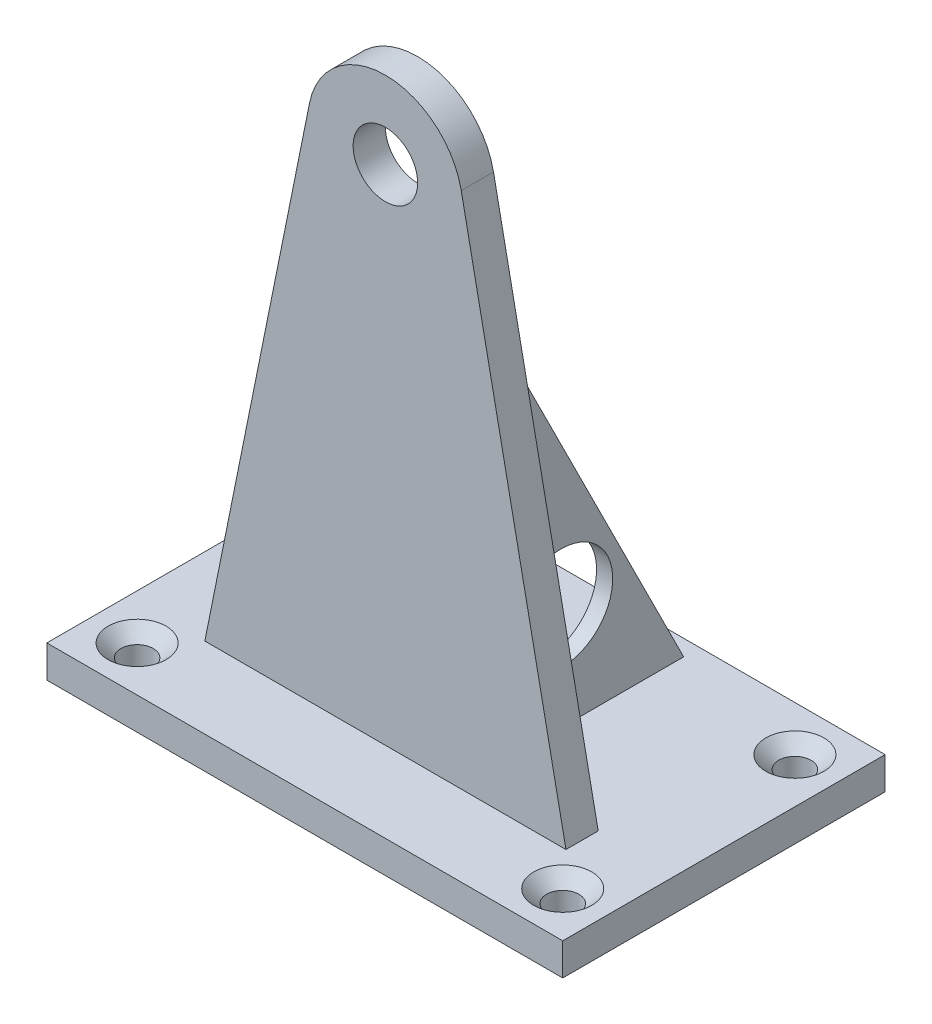
ISO-10303-21;
HEADER;
FILE_DESCRIPTION(('STEP AP214'),'2;1');
FILE_NAME('part.step','',(''),(''),'','','');
FILE_SCHEMA(('AUTOMOTIVE_DESIGN { 1 0 10303 214 1 1 1 1 }'));
ENDSEC;
DATA;
#1=APPLICATION_CONTEXT('core data for automotive mechanical design processes');
#2=APPLICATION_PROTOCOL_DEFINITION('international standard','automotive_design',2000,#1);
#3=PRODUCT_CONTEXT('',#1,'mechanical');
#4=PRODUCT('Part','Part','',(#3));
#5=PRODUCT_RELATED_PRODUCT_CATEGORY('part','',(#4));
#6=PRODUCT_DEFINITION_FORMATION('','',#4);
#7=PRODUCT_DEFINITION_CONTEXT('part definition',#1,'design');
#8=PRODUCT_DEFINITION('design','',#6,#7);
#9=PRODUCT_DEFINITION_SHAPE('','',#8);
#10=(LENGTH_UNIT() NAMED_UNIT(*) SI_UNIT(.MILLI.,.METRE.));
#11=(NAMED_UNIT(*) PLANE_ANGLE_UNIT() SI_UNIT($,.RADIAN.));
#12=(NAMED_UNIT(*) SI_UNIT($,.STERADIAN.) SOLID_ANGLE_UNIT());
#13=UNCERTAINTY_MEASURE_WITH_UNIT(LENGTH_MEASURE(1.E-05),#10,'distance_accuracy_value','');
#14=(GEOMETRIC_REPRESENTATION_CONTEXT(3) GLOBAL_UNCERTAINTY_ASSIGNED_CONTEXT((#13)) GLOBAL_UNIT_ASSIGNED_CONTEXT((#10,
#11,#12)) REPRESENTATION_CONTEXT('',''));
#15=CARTESIAN_POINT('',(0.,0.,0.));
#16=DIRECTION('',(0.,0.,1.));
#17=DIRECTION('',(1.,0.,0.));
#18=AXIS2_PLACEMENT_3D('',#15,#16,#17);
#19=CARTESIAN_POINT('',(40.,5.,25.));
#20=DIRECTION('',(-1.,0.,0.));
#21=DIRECTION('',(0.,0.,1.));
#22=AXIS2_PLACEMENT_3D('',#19,#20,#21);
#23=PLANE('',#22);
#24=DIRECTION('',(0.,0.,-1.));
#25=VECTOR('',#24,1.);
#26=CARTESIAN_POINT('',(40.,0.,25.));
#27=LINE('',#26,#25);
#28=CARTESIAN_POINT('',(40.,0.,25.));
#29=VERTEX_POINT('',#28);
#30=CARTESIAN_POINT('',(40.,0.,-25.));
#31=VERTEX_POINT('',#30);
#32=EDGE_CURVE('E264',#29,#31,#27,.T.);
#33=ORIENTED_EDGE('',*,*,#32,.T.);
#34=DIRECTION('',(0.,-1.,0.));
#35=VECTOR('',#34,1.);
#36=CARTESIAN_POINT('',(40.,5.,-25.));
#37=LINE('',#36,#35);
#38=CARTESIAN_POINT('',(40.,5.,-25.));
#39=VERTEX_POINT('',#38);
#40=EDGE_CURVE('E304',#39,#31,#37,.T.);
#41=ORIENTED_EDGE('',*,*,#40,.F.);
#42=DIRECTION('',(0.,0.,-1.));
#43=VECTOR('',#42,1.);
#44=CARTESIAN_POINT('',(40.,5.,25.));
#45=LINE('',#44,#43);
#46=CARTESIAN_POINT('',(40.,5.,25.));
#47=VERTEX_POINT('',#46);
#48=EDGE_CURVE('E267',#47,#39,#45,.T.);
#49=ORIENTED_EDGE('',*,*,#48,.F.);
#50=DIRECTION('',(0.,-1.,0.));
#51=VECTOR('',#50,1.);
#52=CARTESIAN_POINT('',(40.,5.,25.));
#53=LINE('',#52,#51);
#54=EDGE_CURVE('E281',#47,#29,#53,.T.);
#55=ORIENTED_EDGE('',*,*,#54,.T.);
#56=EDGE_LOOP('',(#33,#41,#49,#55));
#57=FACE_BOUND('',#56,.T.);
#58=ADVANCED_FACE('F52',(#57),#23,.F.);
#59=CARTESIAN_POINT('',(-40.,5.,-25.));
#60=DIRECTION('',(0.,0.,1.));
#61=DIRECTION('',(1.,0.,0.));
#62=AXIS2_PLACEMENT_3D('',#59,#60,#61);
#63=PLANE('',#62);
#64=DIRECTION('',(-1.,0.,0.));
#65=VECTOR('',#64,1.);
#66=CARTESIAN_POINT('',(-40.,0.,-25.));
#67=LINE('',#66,#65);
#68=CARTESIAN_POINT('',(-40.,0.,-25.));
#69=VERTEX_POINT('',#68);
#70=EDGE_CURVE('E285',#31,#69,#67,.T.);
#71=ORIENTED_EDGE('',*,*,#70,.T.);
#72=DIRECTION('',(0.,-1.,0.));
#73=VECTOR('',#72,1.);
#74=CARTESIAN_POINT('',(-40.,5.,-25.));
#75=LINE('',#74,#73);
#76=CARTESIAN_POINT('',(-40.,5.,-25.));
#77=VERTEX_POINT('',#76);
#78=EDGE_CURVE('E300',#77,#69,#75,.T.);
#79=ORIENTED_EDGE('',*,*,#78,.F.);
#80=DIRECTION('',(-1.,0.,0.));
#81=VECTOR('',#80,1.);
#82=CARTESIAN_POINT('',(-40.,5.,-25.));
#83=LINE('',#82,#81);
#84=EDGE_CURVE('E271',#39,#77,#83,.T.);
#85=ORIENTED_EDGE('',*,*,#84,.F.);
#86=ORIENTED_EDGE('',*,*,#40,.T.);
#87=EDGE_LOOP('',(#71,#79,#85,#86));
#88=FACE_BOUND('',#87,.T.);
#89=ADVANCED_FACE('F363',(#88),#63,.F.);
#90=CARTESIAN_POINT('',(-40.,5.,25.));
#91=DIRECTION('',(1.,0.,0.));
#92=DIRECTION('',(0.,0.,-1.));
#93=AXIS2_PLACEMENT_3D('',#90,#91,#92);
#94=PLANE('',#93);
#95=DIRECTION('',(0.,0.,1.));
#96=VECTOR('',#95,1.);
#97=CARTESIAN_POINT('',(-40.,0.,25.));
#98=LINE('',#97,#96);
#99=CARTESIAN_POINT('',(-40.,0.,25.));
#100=VERTEX_POINT('',#99);
#101=EDGE_CURVE('E288',#69,#100,#98,.T.);
#102=ORIENTED_EDGE('',*,*,#101,.T.);
#103=DIRECTION('',(0.,-1.,0.));
#104=VECTOR('',#103,1.);
#105=CARTESIAN_POINT('',(-40.,5.,25.));
#106=LINE('',#105,#104);
#107=CARTESIAN_POINT('',(-40.,5.,25.));
#108=VERTEX_POINT('',#107);
#109=EDGE_CURVE('E296',#108,#100,#106,.T.);
#110=ORIENTED_EDGE('',*,*,#109,.F.);
#111=DIRECTION('',(0.,0.,1.));
#112=VECTOR('',#111,1.);
#113=CARTESIAN_POINT('',(-40.,5.,25.));
#114=LINE('',#113,#112);
#115=EDGE_CURVE('E275',#77,#108,#114,.T.);
#116=ORIENTED_EDGE('',*,*,#115,.F.);
#117=ORIENTED_EDGE('',*,*,#78,.T.);
#118=EDGE_LOOP('',(#102,#110,#116,#117));
#119=FACE_BOUND('',#118,.T.);
#120=ADVANCED_FACE('F369',(#119),#94,.F.);
#121=CARTESIAN_POINT('',(-40.,5.,25.));
#122=DIRECTION('',(0.,0.,-1.));
#123=DIRECTION('',(-1.,0.,0.));
#124=AXIS2_PLACEMENT_3D('',#121,#122,#123);
#125=PLANE('',#124);
#126=DIRECTION('',(1.,0.,0.));
#127=VECTOR('',#126,1.);
#128=CARTESIAN_POINT('',(-40.,0.,25.));
#129=LINE('',#128,#127);
#130=EDGE_CURVE('E272',#100,#29,#129,.T.);
#131=ORIENTED_EDGE('',*,*,#130,.T.);
#132=ORIENTED_EDGE('',*,*,#54,.F.);
#133=DIRECTION('',(1.,0.,0.));
#134=VECTOR('',#133,1.);
#135=CARTESIAN_POINT('',(-40.,5.,25.));
#136=LINE('',#135,#134);
#137=EDGE_CURVE('E278',#108,#47,#136,.T.);
#138=ORIENTED_EDGE('',*,*,#137,.F.);
#139=ORIENTED_EDGE('',*,*,#109,.T.);
#140=EDGE_LOOP('',(#131,#132,#138,#139));
#141=FACE_BOUND('',#140,.T.);
#142=ADVANCED_FACE('F486',(#141),#125,.F.);
#143=CARTESIAN_POINT('',(0.,5.,0.));
#144=DIRECTION('',(0.,-1.,0.));
#145=DIRECTION('',(0.,0.,-1.));
#146=AXIS2_PLACEMENT_3D('',#143,#144,#145);
#147=PLANE('',#146);
#148=CARTESIAN_POINT('',(33.,5.,-18.));
#149=DIRECTION('',(0.,-1.,0.));
#150=DIRECTION('',(0.,0.,-1.));
#151=AXIS2_PLACEMENT_3D('',#148,#149,#150);
#152=CIRCLE('',#151,4.50000000000003);
#153=CARTESIAN_POINT('',(33.,5.,-22.5));
#154=VERTEX_POINT('',#153);
#155=EDGE_CURVE('E332',#154,#154,#152,.T.);
#156=ORIENTED_EDGE('',*,*,#155,.T.);
#157=EDGE_LOOP('',(#156));
#158=FACE_BOUND('',#157,.T.);
#159=CARTESIAN_POINT('',(-33.,5.,-18.));
#160=DIRECTION('',(0.,-1.,0.));
#161=DIRECTION('',(0.,0.,-1.));
#162=AXIS2_PLACEMENT_3D('',#159,#160,#161);
#163=CIRCLE('',#162,4.50000000000003);
#164=CARTESIAN_POINT('',(-33.,5.,-22.5));
#165=VERTEX_POINT('',#164);
#166=EDGE_CURVE('E328',#165,#165,#163,.T.);
#167=ORIENTED_EDGE('',*,*,#166,.T.);
#168=EDGE_LOOP('',(#167));
#169=FACE_BOUND('',#168,.T.);
#170=CARTESIAN_POINT('',(-33.,5.,18.));
#171=DIRECTION('',(0.,-1.,0.));
#172=DIRECTION('',(0.,0.,-1.));
#173=AXIS2_PLACEMENT_3D('',#170,#171,#172);
#174=CIRCLE('',#173,4.50000000000003);
#175=CARTESIAN_POINT('',(-33.,5.,13.5));
#176=VERTEX_POINT('',#175);
#177=EDGE_CURVE('E324',#176,#176,#174,.T.);
#178=ORIENTED_EDGE('',*,*,#177,.T.);
#179=EDGE_LOOP('',(#178));
#180=FACE_BOUND('',#179,.T.);
#181=CARTESIAN_POINT('',(33.,5.,18.));
#182=DIRECTION('',(0.,-1.,0.));
#183=DIRECTION('',(0.,0.,-1.));
#184=AXIS2_PLACEMENT_3D('',#181,#182,#183);
#185=CIRCLE('',#184,4.50000000000003);
#186=CARTESIAN_POINT('',(33.,5.,13.5));
#187=VERTEX_POINT('',#186);
#188=EDGE_CURVE('E320',#187,#187,#185,.T.);
#189=ORIENTED_EDGE('',*,*,#188,.T.);
#190=EDGE_LOOP('',(#189));
#191=FACE_BOUND('',#190,.T.);
#192=DIRECTION('',(0.,0.,1.));
#193=VECTOR('',#192,1.);
#194=CARTESIAN_POINT('',(28.,5.,7.5));
#195=LINE('',#194,#193);
#196=CARTESIAN_POINT('',(28.,5.,7.5));
#197=VERTEX_POINT('',#196);
#198=CARTESIAN_POINT('',(28.,5.,12.5));
#199=VERTEX_POINT('',#198);
#200=EDGE_CURVE('E195',#197,#199,#195,.T.);
#201=ORIENTED_EDGE('',*,*,#200,.T.);
#202=DIRECTION('',(1.,0.,0.));
#203=VECTOR('',#202,1.);
#204=CARTESIAN_POINT('',(0.,5.,12.5));
#205=LINE('',#204,#203);
#206=CARTESIAN_POINT('',(-28.,5.,12.5));
#207=VERTEX_POINT('',#206);
#208=EDGE_CURVE('E240',#207,#199,#205,.T.);
#209=ORIENTED_EDGE('',*,*,#208,.F.);
#210=DIRECTION('',(0.,0.,1.));
#211=VECTOR('',#210,1.);
#212=CARTESIAN_POINT('',(-28.,5.,7.5));
#213=LINE('',#212,#211);
#214=CARTESIAN_POINT('',(-28.,5.,7.5));
#215=VERTEX_POINT('',#214);
#216=EDGE_CURVE('E260',#215,#207,#213,.T.);
#217=ORIENTED_EDGE('',*,*,#216,.F.);
#218=DIRECTION('',(1.,0.,0.));
#219=VECTOR('',#218,1.);
#220=CARTESIAN_POINT('',(0.,5.,7.5));
#221=LINE('',#220,#219);
#222=CARTESIAN_POINT('',(-11.25,5.,7.5));
#223=VERTEX_POINT('',#222);
#224=EDGE_CURVE('E245',#215,#223,#221,.T.);
#225=ORIENTED_EDGE('',*,*,#224,.T.);
#226=DIRECTION('',(0.,0.,1.));
#227=VECTOR('',#226,1.);
#228=CARTESIAN_POINT('',(-11.25,5.,0.));
#229=LINE('',#228,#227);
#230=CARTESIAN_POINT('',(-11.25,5.,-22.5));
#231=VERTEX_POINT('',#230);
#232=EDGE_CURVE('E77',#231,#223,#229,.T.);
#233=ORIENTED_EDGE('',*,*,#232,.F.);
#234=DIRECTION('',(-1.,0.,0.));
#235=VECTOR('',#234,1.);
#236=CARTESIAN_POINT('',(0.,5.,-22.5));
#237=LINE('',#236,#235);
#238=CARTESIAN_POINT('',(-8.75,5.,-22.5));
#239=VERTEX_POINT('',#238);
#240=EDGE_CURVE('E230',#231,#239,#237,.F.);
#241=ORIENTED_EDGE('',*,*,#240,.T.);
#242=DIRECTION('',(0.,0.,1.));
#243=VECTOR('',#242,1.);
#244=CARTESIAN_POINT('',(-8.75,5.,0.));
#245=LINE('',#244,#243);
#246=CARTESIAN_POINT('',(-8.75,5.,7.5));
#247=VERTEX_POINT('',#246);
#248=EDGE_CURVE('E221',#239,#247,#245,.T.);
#249=ORIENTED_EDGE('',*,*,#248,.T.);
#250=CARTESIAN_POINT('',(8.75,5.,7.5));
#251=VERTEX_POINT('',#250);
#252=EDGE_CURVE('E250',#247,#251,#221,.T.);
#253=ORIENTED_EDGE('',*,*,#252,.T.);
#254=DIRECTION('',(0.,0.,-1.));
#255=VECTOR('',#254,1.);
#256=CARTESIAN_POINT('',(8.75,5.,0.));
#257=LINE('',#256,#255);
#258=CARTESIAN_POINT('',(8.75,5.,-22.5));
#259=VERTEX_POINT('',#258);
#260=EDGE_CURVE('E180',#251,#259,#257,.T.);
#261=ORIENTED_EDGE('',*,*,#260,.T.);
#262=DIRECTION('',(1.,0.,0.));
#263=VECTOR('',#262,1.);
#264=CARTESIAN_POINT('',(0.,5.,-22.5));
#265=LINE('',#264,#263);
#266=CARTESIAN_POINT('',(11.25,5.,-22.5));
#267=VERTEX_POINT('',#266);
#268=EDGE_CURVE('E167',#259,#267,#265,.T.);
#269=ORIENTED_EDGE('',*,*,#268,.T.);
#270=DIRECTION('',(0.,0.,-1.));
#271=VECTOR('',#270,1.);
#272=CARTESIAN_POINT('',(11.25,5.,0.));
#273=LINE('',#272,#271);
#274=CARTESIAN_POINT('',(11.25,5.,7.5));
#275=VERTEX_POINT('',#274);
#276=EDGE_CURVE('E154',#275,#267,#273,.T.);
#277=ORIENTED_EDGE('',*,*,#276,.F.);
#278=EDGE_CURVE('E244',#275,#197,#221,.T.);
#279=ORIENTED_EDGE('',*,*,#278,.T.);
#280=EDGE_LOOP('',(#201,#209,#217,#225,#233,#241,#249,#253,#261,#269,#277,#279));
#281=FACE_BOUND('',#280,.T.);
#282=ORIENTED_EDGE('',*,*,#137,.T.);
#283=ORIENTED_EDGE('',*,*,#48,.T.);
#284=ORIENTED_EDGE('',*,*,#84,.T.);
#285=ORIENTED_EDGE('',*,*,#115,.T.);
#286=EDGE_LOOP('',(#282,#283,#284,#285));
#287=FACE_BOUND('',#286,.T.);
#288=ADVANCED_FACE('F177',(#158,#169,#180,#191,#281,#287),#147,.F.);
#289=CARTESIAN_POINT('',(0.,0.,0.));
#290=DIRECTION('',(0.,-1.,0.));
#291=DIRECTION('',(0.,0.,-1.));
#292=AXIS2_PLACEMENT_3D('',#289,#290,#291);
#293=PLANE('',#292);
#294=CARTESIAN_POINT('',(33.,0.,-18.));
#295=DIRECTION('',(0.,1.,0.));
#296=DIRECTION('',(0.,0.,-1.));
#297=AXIS2_PLACEMENT_3D('',#294,#295,#296);
#298=CIRCLE('',#297,2.5);
#299=CARTESIAN_POINT('',(33.,0.,-20.5));
#300=VERTEX_POINT('',#299);
#301=EDGE_CURVE('E399',#300,#300,#298,.T.);
#302=ORIENTED_EDGE('',*,*,#301,.T.);
#303=EDGE_LOOP('',(#302));
#304=FACE_BOUND('',#303,.T.);
#305=CARTESIAN_POINT('',(33.,0.,18.));
#306=DIRECTION('',(0.,1.,0.));
#307=DIRECTION('',(0.,0.,1.));
#308=AXIS2_PLACEMENT_3D('',#305,#306,#307);
#309=CIRCLE('',#308,2.5);
#310=CARTESIAN_POINT('',(33.,0.,20.5));
#311=VERTEX_POINT('',#310);
#312=EDGE_CURVE('E402',#311,#311,#309,.T.);
#313=ORIENTED_EDGE('',*,*,#312,.T.);
#314=EDGE_LOOP('',(#313));
#315=FACE_BOUND('',#314,.T.);
#316=CARTESIAN_POINT('',(-33.,0.,18.));
#317=DIRECTION('',(0.,1.,0.));
#318=DIRECTION('',(0.,0.,-1.));
#319=AXIS2_PLACEMENT_3D('',#316,#317,#318);
#320=CIRCLE('',#319,2.5);
#321=CARTESIAN_POINT('',(-33.,0.,15.5));
#322=VERTEX_POINT('',#321);
#323=EDGE_CURVE('E409',#322,#322,#320,.T.);
#324=ORIENTED_EDGE('',*,*,#323,.T.);
#325=EDGE_LOOP('',(#324));
#326=FACE_BOUND('',#325,.T.);
#327=CARTESIAN_POINT('',(-33.,0.,-18.));
#328=DIRECTION('',(0.,1.,0.));
#329=DIRECTION('',(0.,0.,1.));
#330=AXIS2_PLACEMENT_3D('',#327,#328,#329);
#331=CIRCLE('',#330,2.5);
#332=CARTESIAN_POINT('',(-33.,0.,-15.5));
#333=VERTEX_POINT('',#332);
#334=EDGE_CURVE('E316',#333,#333,#331,.T.);
#335=ORIENTED_EDGE('',*,*,#334,.T.);
#336=EDGE_LOOP('',(#335));
#337=FACE_BOUND('',#336,.T.);
#338=ORIENTED_EDGE('',*,*,#101,.F.);
#339=ORIENTED_EDGE('',*,*,#70,.F.);
#340=ORIENTED_EDGE('',*,*,#32,.F.);
#341=ORIENTED_EDGE('',*,*,#130,.F.);
#342=EDGE_LOOP('',(#338,#339,#340,#341));
#343=FACE_BOUND('',#342,.T.);
#344=ADVANCED_FACE('F479',(#304,#315,#326,#337,#343),#293,.T.);
#345=CARTESIAN_POINT('',(-28.,5.,7.5));
#346=DIRECTION('',(-0.98019801980198,0.198019801980198,0.));
#347=DIRECTION('',(-0.198019801980198,-0.98019801980198,0.));
#348=AXIS2_PLACEMENT_3D('',#345,#346,#347);
#349=PLANE('',#348);
#350=DIRECTION('',(-0.198019801980198,-0.98019801980198,0.));
#351=VECTOR('',#350,1.);
#352=CARTESIAN_POINT('',(-28.,5.,12.5));
#353=LINE('',#352,#351);
#354=CARTESIAN_POINT('',(-11.7623762376238,85.3762376237624,12.5));
#355=VERTEX_POINT('',#354);
#356=EDGE_CURVE('E254',#355,#207,#353,.T.);
#357=ORIENTED_EDGE('',*,*,#356,.F.);
#358=DIRECTION('',(0.,0.,1.));
#359=VECTOR('',#358,1.);
#360=CARTESIAN_POINT('',(-11.7623762376238,85.3762376237624,7.5));
#361=LINE('',#360,#359);
#362=CARTESIAN_POINT('',(-11.7623762376238,85.3762376237624,7.5));
#363=VERTEX_POINT('',#362);
#364=EDGE_CURVE('E249',#363,#355,#361,.T.);
#365=ORIENTED_EDGE('',*,*,#364,.F.);
#366=DIRECTION('',(-0.198019801980198,-0.98019801980198,0.));
#367=VECTOR('',#366,1.);
#368=CARTESIAN_POINT('',(-28.,5.,7.5));
#369=LINE('',#368,#367);
#370=EDGE_CURVE('E239',#363,#215,#369,.T.);
#371=ORIENTED_EDGE('',*,*,#370,.T.);
#372=ORIENTED_EDGE('',*,*,#216,.T.);
#373=EDGE_LOOP('',(#357,#365,#371,#372));
#374=FACE_BOUND('',#373,.T.);
#375=ADVANCED_FACE('F476',(#374),#349,.T.);
#376=CARTESIAN_POINT('',(0.,83.,7.5));
#377=DIRECTION('',(0.,0.,1.));
#378=DIRECTION('',(1.,0.,0.));
#379=AXIS2_PLACEMENT_3D('',#376,#377,#378);
#380=CYLINDRICAL_SURFACE('',#379,12.);
#381=CARTESIAN_POINT('',(0.,83.,12.5));
#382=DIRECTION('',(0.,0.,1.));
#383=DIRECTION('',(-1.,0.,0.));
#384=AXIS2_PLACEMENT_3D('',#381,#382,#383);
#385=CIRCLE('',#384,12.);
#386=CARTESIAN_POINT('',(11.7623762376238,85.3762376237624,12.5));
#387=VERTEX_POINT('',#386);
#388=EDGE_CURVE('E234',#387,#355,#385,.T.);
#389=ORIENTED_EDGE('',*,*,#388,.F.);
#390=DIRECTION('',(0.,0.,1.));
#391=VECTOR('',#390,1.);
#392=CARTESIAN_POINT('',(11.7623762376238,85.3762376237624,7.5));
#393=LINE('',#392,#391);
#394=CARTESIAN_POINT('',(11.7623762376238,85.3762376237624,7.5));
#395=VERTEX_POINT('',#394);
#396=EDGE_CURVE('E197',#395,#387,#393,.T.);
#397=ORIENTED_EDGE('',*,*,#396,.F.);
#398=CARTESIAN_POINT('',(0.,83.,7.5));
#399=DIRECTION('',(0.,0.,1.));
#400=DIRECTION('',(-1.,0.,0.));
#401=AXIS2_PLACEMENT_3D('',#398,#399,#400);
#402=CIRCLE('',#401,12.);
#403=EDGE_CURVE('E235',#395,#363,#402,.T.);
#404=ORIENTED_EDGE('',*,*,#403,.T.);
#405=ORIENTED_EDGE('',*,*,#364,.T.);
#406=EDGE_LOOP('',(#389,#397,#404,#405));
#407=FACE_BOUND('',#406,.T.);
#408=ADVANCED_FACE('F471',(#407),#380,.T.);
#409=CARTESIAN_POINT('',(0.,83.,7.5));
#410=DIRECTION('',(0.,0.,-1.));
#411=DIRECTION('',(-1.,0.,0.));
#412=AXIS2_PLACEMENT_3D('',#409,#410,#411);
#413=PLANE('',#412);
#414=CARTESIAN_POINT('',(0.,83.,7.5));
#415=DIRECTION('',(0.,0.,1.));
#416=DIRECTION('',(1.,0.,0.));
#417=AXIS2_PLACEMENT_3D('',#414,#415,#416);
#418=CIRCLE('',#417,5.);
#419=CARTESIAN_POINT('',(5.,83.,7.5));
#420=VERTEX_POINT('',#419);
#421=EDGE_CURVE('E403',#420,#420,#418,.T.);
#422=ORIENTED_EDGE('',*,*,#421,.T.);
#423=EDGE_LOOP('',(#422));
#424=FACE_BOUND('',#423,.T.);
#425=DIRECTION('',(0.,1.,0.));
#426=VECTOR('',#425,1.);
#427=CARTESIAN_POINT('',(8.75,83.,7.5));
#428=LINE('',#427,#426);
#429=CARTESIAN_POINT('',(8.75,65.,7.5));
#430=VERTEX_POINT('',#429);
#431=EDGE_CURVE('E162',#251,#430,#428,.T.);
#432=ORIENTED_EDGE('',*,*,#431,.F.);
#433=ORIENTED_EDGE('',*,*,#252,.F.);
#434=DIRECTION('',(0.,-1.,0.));
#435=VECTOR('',#434,1.);
#436=CARTESIAN_POINT('',(-8.75,83.,7.5));
#437=LINE('',#436,#435);
#438=CARTESIAN_POINT('',(-8.75,65.,7.5));
#439=VERTEX_POINT('',#438);
#440=EDGE_CURVE('E218',#439,#247,#437,.T.);
#441=ORIENTED_EDGE('',*,*,#440,.F.);
#442=DIRECTION('',(-1.,0.,0.));
#443=VECTOR('',#442,1.);
#444=CARTESIAN_POINT('',(0.,65.,7.5));
#445=LINE('',#444,#443);
#446=CARTESIAN_POINT('',(-11.25,65.,7.5));
#447=VERTEX_POINT('',#446);
#448=EDGE_CURVE('E225',#447,#439,#445,.F.);
#449=ORIENTED_EDGE('',*,*,#448,.F.);
#450=DIRECTION('',(0.,-1.,0.));
#451=VECTOR('',#450,1.);
#452=CARTESIAN_POINT('',(-11.25,83.,7.5));
#453=LINE('',#452,#451);
#454=EDGE_CURVE('E213',#447,#223,#453,.T.);
#455=ORIENTED_EDGE('',*,*,#454,.T.);
#456=ORIENTED_EDGE('',*,*,#224,.F.);
#457=ORIENTED_EDGE('',*,*,#370,.F.);
#458=ORIENTED_EDGE('',*,*,#403,.F.);
#459=DIRECTION('',(0.198019801980198,-0.98019801980198,0.));
#460=VECTOR('',#459,1.);
#461=CARTESIAN_POINT('',(28.,5.,7.5));
#462=LINE('',#461,#460);
#463=EDGE_CURVE('E188',#395,#197,#462,.T.);
#464=ORIENTED_EDGE('',*,*,#463,.T.);
#465=ORIENTED_EDGE('',*,*,#278,.F.);
#466=DIRECTION('',(0.,1.,0.));
#467=VECTOR('',#466,1.);
#468=CARTESIAN_POINT('',(11.25,83.,7.5));
#469=LINE('',#468,#467);
#470=CARTESIAN_POINT('',(11.25,65.,7.5));
#471=VERTEX_POINT('',#470);
#472=EDGE_CURVE('E157',#275,#471,#469,.T.);
#473=ORIENTED_EDGE('',*,*,#472,.T.);
#474=DIRECTION('',(1.,0.,0.));
#475=VECTOR('',#474,1.);
#476=CARTESIAN_POINT('',(0.,65.,7.5));
#477=LINE('',#476,#475);
#478=EDGE_CURVE('E170',#430,#471,#477,.T.);
#479=ORIENTED_EDGE('',*,*,#478,.F.);
#480=EDGE_LOOP('',(#432,#433,#441,#449,#455,#456,#457,#458,#464,#465,#473,#479));
#481=FACE_BOUND('',#480,.T.);
#482=ADVANCED_FACE('F434',(#424,#481),#413,.T.);
#483=CARTESIAN_POINT('',(0.,83.,12.5));
#484=DIRECTION('',(0.,0.,-1.));
#485=DIRECTION('',(-1.,0.,0.));
#486=AXIS2_PLACEMENT_3D('',#483,#484,#485);
#487=PLANE('',#486);
#488=CARTESIAN_POINT('',(0.,83.,12.5));
#489=DIRECTION('',(0.,0.,1.));
#490=DIRECTION('',(1.,0.,0.));
#491=AXIS2_PLACEMENT_3D('',#488,#489,#490);
#492=CIRCLE('',#491,5.);
#493=CARTESIAN_POINT('',(5.,83.,12.5));
#494=VERTEX_POINT('',#493);
#495=EDGE_CURVE('E412',#494,#494,#492,.T.);
#496=ORIENTED_EDGE('',*,*,#495,.F.);
#497=EDGE_LOOP('',(#496));
#498=FACE_BOUND('',#497,.T.);
#499=ORIENTED_EDGE('',*,*,#208,.T.);
#500=DIRECTION('',(0.198019801980198,-0.98019801980198,0.));
#501=VECTOR('',#500,1.);
#502=CARTESIAN_POINT('',(28.,5.,12.5));
#503=LINE('',#502,#501);
#504=EDGE_CURVE('E182',#387,#199,#503,.T.);
#505=ORIENTED_EDGE('',*,*,#504,.F.);
#506=ORIENTED_EDGE('',*,*,#388,.T.);
#507=ORIENTED_EDGE('',*,*,#356,.T.);
#508=EDGE_LOOP('',(#499,#505,#506,#507));
#509=FACE_BOUND('',#508,.T.);
#510=ADVANCED_FACE('F468',(#498,#509),#487,.F.);
#511=CARTESIAN_POINT('',(-10.,65.,7.5));
#512=DIRECTION('',(0.,-0.447213595499958,0.894427190999916));
#513=DIRECTION('',(0.,-0.894427190999916,-0.447213595499958));
#514=AXIS2_PLACEMENT_3D('',#511,#512,#513);
#515=PLANE('',#514);
#516=ORIENTED_EDGE('',*,*,#240,.F.);
#517=DIRECTION('',(0.,-0.894427190999916,-0.447213595499958));
#518=VECTOR('',#517,1.);
#519=CARTESIAN_POINT('',(-11.25,65.,7.5));
#520=LINE('',#519,#518);
#521=EDGE_CURVE('E208',#447,#231,#520,.T.);
#522=ORIENTED_EDGE('',*,*,#521,.F.);
#523=ORIENTED_EDGE('',*,*,#448,.T.);
#524=DIRECTION('',(0.,-0.894427190999916,-0.447213595499958));
#525=VECTOR('',#524,1.);
#526=CARTESIAN_POINT('',(-8.75,65.,7.5));
#527=LINE('',#526,#525);
#528=EDGE_CURVE('E209',#439,#239,#527,.T.);
#529=ORIENTED_EDGE('',*,*,#528,.T.);
#530=EDGE_LOOP('',(#516,#522,#523,#529));
#531=FACE_BOUND('',#530,.T.);
#532=ADVANCED_FACE('F447',(#531),#515,.F.);
#533=CARTESIAN_POINT('',(-8.75,47.5,0.));
#534=DIRECTION('',(1.,0.,0.));
#535=DIRECTION('',(0.,0.,-1.));
#536=AXIS2_PLACEMENT_3D('',#533,#534,#535);
#537=PLANE('',#536);
#538=CARTESIAN_POINT('',(-8.75,21.,-3.5));
#539=DIRECTION('',(1.,0.,0.));
#540=DIRECTION('',(0.,0.,-1.));
#541=AXIS2_PLACEMENT_3D('',#538,#539,#540);
#542=CIRCLE('',#541,8.);
#543=CARTESIAN_POINT('',(-8.75,21.,-11.5));
#544=VERTEX_POINT('',#543);
#545=EDGE_CURVE('E204',#544,#544,#542,.T.);
#546=ORIENTED_EDGE('',*,*,#545,.F.);
#547=EDGE_LOOP('',(#546));
#548=FACE_BOUND('',#547,.T.);
#549=ORIENTED_EDGE('',*,*,#248,.F.);
#550=ORIENTED_EDGE('',*,*,#528,.F.);
#551=ORIENTED_EDGE('',*,*,#440,.T.);
#552=EDGE_LOOP('',(#549,#550,#551));
#553=FACE_BOUND('',#552,.T.);
#554=ADVANCED_FACE('F445',(#548,#553),#537,.T.);
#555=CARTESIAN_POINT('',(-11.25,47.5,0.));
#556=DIRECTION('',(1.,0.,0.));
#557=DIRECTION('',(0.,0.,-1.));
#558=AXIS2_PLACEMENT_3D('',#555,#556,#557);
#559=PLANE('',#558);
#560=CARTESIAN_POINT('',(-11.25,21.,-3.5));
#561=DIRECTION('',(1.,0.,0.));
#562=DIRECTION('',(0.,0.,-1.));
#563=AXIS2_PLACEMENT_3D('',#560,#561,#562);
#564=CIRCLE('',#563,8.);
#565=CARTESIAN_POINT('',(-11.25,21.,-11.5));
#566=VERTEX_POINT('',#565);
#567=EDGE_CURVE('E201',#566,#566,#564,.T.);
#568=ORIENTED_EDGE('',*,*,#567,.T.);
#569=EDGE_LOOP('',(#568));
#570=FACE_BOUND('',#569,.T.);
#571=ORIENTED_EDGE('',*,*,#521,.T.);
#572=ORIENTED_EDGE('',*,*,#232,.T.);
#573=ORIENTED_EDGE('',*,*,#454,.F.);
#574=EDGE_LOOP('',(#571,#572,#573));
#575=FACE_BOUND('',#574,.T.);
#576=ADVANCED_FACE('F451',(#570,#575),#559,.F.);
#577=CARTESIAN_POINT('',(-12.5,21.,-3.5));
#578=DIRECTION('',(1.,0.,0.));
#579=DIRECTION('',(0.,0.,-1.));
#580=AXIS2_PLACEMENT_3D('',#577,#578,#579);
#581=CYLINDRICAL_SURFACE('',#580,8.);
#582=ORIENTED_EDGE('',*,*,#545,.T.);
#583=EDGE_LOOP('',(#582));
#584=FACE_BOUND('',#583,.T.);
#585=ORIENTED_EDGE('',*,*,#567,.F.);
#586=EDGE_LOOP('',(#585));
#587=FACE_BOUND('',#586,.T.);
#588=ADVANCED_FACE('F453',(#584,#587),#581,.F.);
#589=CARTESIAN_POINT('',(28.,5.,7.5));
#590=DIRECTION('',(-0.98019801980198,-0.198019801980198,0.));
#591=DIRECTION('',(0.198019801980198,-0.98019801980198,0.));
#592=AXIS2_PLACEMENT_3D('',#589,#590,#591);
#593=PLANE('',#592);
#594=ORIENTED_EDGE('',*,*,#504,.T.);
#595=ORIENTED_EDGE('',*,*,#200,.F.);
#596=ORIENTED_EDGE('',*,*,#463,.F.);
#597=ORIENTED_EDGE('',*,*,#396,.T.);
#598=EDGE_LOOP('',(#594,#595,#596,#597));
#599=FACE_BOUND('',#598,.T.);
#600=ADVANCED_FACE('F460',(#599),#593,.F.);
#601=CARTESIAN_POINT('',(10.,65.,7.5));
#602=DIRECTION('',(0.,0.447213595499958,-0.894427190999916));
#603=DIRECTION('',(0.,-0.894427190999916,-0.447213595499958));
#604=AXIS2_PLACEMENT_3D('',#601,#602,#603);
#605=PLANE('',#604);
#606=ORIENTED_EDGE('',*,*,#268,.F.);
#607=DIRECTION('',(0.,-0.894427190999916,-0.447213595499958));
#608=VECTOR('',#607,1.);
#609=CARTESIAN_POINT('',(8.75,65.,7.5));
#610=LINE('',#609,#608);
#611=EDGE_CURVE('E172',#430,#259,#610,.T.);
#612=ORIENTED_EDGE('',*,*,#611,.F.);
#613=ORIENTED_EDGE('',*,*,#478,.T.);
#614=DIRECTION('',(0.,-0.894427190999916,-0.447213595499958));
#615=VECTOR('',#614,1.);
#616=CARTESIAN_POINT('',(11.25,65.,7.5));
#617=LINE('',#616,#615);
#618=EDGE_CURVE('E69',#471,#267,#617,.T.);
#619=ORIENTED_EDGE('',*,*,#618,.T.);
#620=EDGE_LOOP('',(#606,#612,#613,#619));
#621=FACE_BOUND('',#620,.T.);
#622=ADVANCED_FACE('F165',(#621),#605,.T.);
#623=CARTESIAN_POINT('',(8.75,47.5,0.));
#624=DIRECTION('',(-1.,0.,0.));
#625=DIRECTION('',(0.,0.,1.));
#626=AXIS2_PLACEMENT_3D('',#623,#624,#625);
#627=PLANE('',#626);
#628=CARTESIAN_POINT('',(8.75,21.,-3.5));
#629=DIRECTION('',(-1.,0.,0.));
#630=DIRECTION('',(0.,0.,1.));
#631=AXIS2_PLACEMENT_3D('',#628,#629,#630);
#632=CIRCLE('',#631,8.);
#633=CARTESIAN_POINT('',(8.75,21.,4.50000000000001));
#634=VERTEX_POINT('',#633);
#635=EDGE_CURVE('E173',#634,#634,#632,.F.);
#636=ORIENTED_EDGE('',*,*,#635,.T.);
#637=EDGE_LOOP('',(#636));
#638=FACE_BOUND('',#637,.T.);
#639=ORIENTED_EDGE('',*,*,#260,.F.);
#640=ORIENTED_EDGE('',*,*,#431,.T.);
#641=ORIENTED_EDGE('',*,*,#611,.T.);
#642=EDGE_LOOP('',(#639,#640,#641));
#643=FACE_BOUND('',#642,.T.);
#644=ADVANCED_FACE('F431',(#638,#643),#627,.T.);
#645=CARTESIAN_POINT('',(11.25,47.5,0.));
#646=DIRECTION('',(-1.,0.,0.));
#647=DIRECTION('',(0.,0.,1.));
#648=AXIS2_PLACEMENT_3D('',#645,#646,#647);
#649=PLANE('',#648);
#650=CARTESIAN_POINT('',(11.25,21.,-3.5));
#651=DIRECTION('',(-1.,0.,0.));
#652=DIRECTION('',(0.,0.,1.));
#653=AXIS2_PLACEMENT_3D('',#650,#651,#652);
#654=CIRCLE('',#653,8.);
#655=CARTESIAN_POINT('',(11.25,21.,4.50000000000001));
#656=VERTEX_POINT('',#655);
#657=EDGE_CURVE('E312',#656,#656,#654,.F.);
#658=ORIENTED_EDGE('',*,*,#657,.F.);
#659=EDGE_LOOP('',(#658));
#660=FACE_BOUND('',#659,.T.);
#661=ORIENTED_EDGE('',*,*,#472,.F.);
#662=ORIENTED_EDGE('',*,*,#276,.T.);
#663=ORIENTED_EDGE('',*,*,#618,.F.);
#664=EDGE_LOOP('',(#661,#662,#663));
#665=FACE_BOUND('',#664,.T.);
#666=ADVANCED_FACE('F155',(#660,#665),#649,.F.);
#667=CARTESIAN_POINT('',(12.5,21.,-3.5));
#668=DIRECTION('',(-1.,0.,0.));
#669=DIRECTION('',(0.,0.,1.));
#670=AXIS2_PLACEMENT_3D('',#667,#668,#669);
#671=CYLINDRICAL_SURFACE('',#670,8.);
#672=ORIENTED_EDGE('',*,*,#635,.F.);
#673=EDGE_LOOP('',(#672));
#674=FACE_BOUND('',#673,.T.);
#675=ORIENTED_EDGE('',*,*,#657,.T.);
#676=EDGE_LOOP('',(#675));
#677=FACE_BOUND('',#676,.T.);
#678=ADVANCED_FACE('F591',(#674,#677),#671,.F.);
#679=CARTESIAN_POINT('',(-33.,0.,-18.));
#680=DIRECTION('',(0.,1.,0.));
#681=DIRECTION('',(0.,0.,1.));
#682=AXIS2_PLACEMENT_3D('',#679,#680,#681);
#683=CYLINDRICAL_SURFACE('',#682,2.5);
#684=CARTESIAN_POINT('',(-33.,2.99999999999999,-18.));
#685=DIRECTION('',(0.,-1.,0.));
#686=DIRECTION('',(0.,0.,-1.));
#687=AXIS2_PLACEMENT_3D('',#684,#685,#686);
#688=CIRCLE('',#687,2.5);
#689=CARTESIAN_POINT('',(-33.,2.99999999999999,-20.5));
#690=VERTEX_POINT('',#689);
#691=EDGE_CURVE('E336',#690,#690,#688,.F.);
#692=ORIENTED_EDGE('',*,*,#691,.T.);
#693=EDGE_LOOP('',(#692));
#694=FACE_BOUND('',#693,.T.);
#695=ORIENTED_EDGE('',*,*,#334,.F.);
#696=EDGE_LOOP('',(#695));
#697=FACE_BOUND('',#696,.T.);
#698=ADVANCED_FACE('F601',(#694,#697),#683,.F.);
#699=CARTESIAN_POINT('',(-33.,0.,18.));
#700=DIRECTION('',(0.,1.,0.));
#701=DIRECTION('',(0.,0.,1.));
#702=AXIS2_PLACEMENT_3D('',#699,#700,#701);
#703=CYLINDRICAL_SURFACE('',#702,2.5);
#704=CARTESIAN_POINT('',(-33.,2.99999999999999,18.));
#705=DIRECTION('',(0.,-1.,0.));
#706=DIRECTION('',(0.,0.,-1.));
#707=AXIS2_PLACEMENT_3D('',#704,#705,#706);
#708=CIRCLE('',#707,2.5);
#709=CARTESIAN_POINT('',(-33.,2.99999999999999,15.5));
#710=VERTEX_POINT('',#709);
#711=EDGE_CURVE('E62',#710,#710,#708,.F.);
#712=ORIENTED_EDGE('',*,*,#711,.T.);
#713=EDGE_LOOP('',(#712));
#714=FACE_BOUND('',#713,.T.);
#715=ORIENTED_EDGE('',*,*,#323,.F.);
#716=EDGE_LOOP('',(#715));
#717=FACE_BOUND('',#716,.T.);
#718=ADVANCED_FACE('F344',(#714,#717),#703,.F.);
#719=CARTESIAN_POINT('',(33.,0.,18.));
#720=DIRECTION('',(0.,1.,0.));
#721=DIRECTION('',(0.,0.,1.));
#722=AXIS2_PLACEMENT_3D('',#719,#720,#721);
#723=CYLINDRICAL_SURFACE('',#722,2.5);
#724=CARTESIAN_POINT('',(33.,2.99999999999999,18.));
#725=DIRECTION('',(0.,-1.,0.));
#726=DIRECTION('',(0.,0.,-1.));
#727=AXIS2_PLACEMENT_3D('',#724,#725,#726);
#728=CIRCLE('',#727,2.5);
#729=CARTESIAN_POINT('',(33.,2.99999999999999,15.5));
#730=VERTEX_POINT('',#729);
#731=EDGE_CURVE('E13',#730,#730,#728,.F.);
#732=ORIENTED_EDGE('',*,*,#731,.T.);
#733=EDGE_LOOP('',(#732));
#734=FACE_BOUND('',#733,.T.);
#735=ORIENTED_EDGE('',*,*,#312,.F.);
#736=EDGE_LOOP('',(#735));
#737=FACE_BOUND('',#736,.T.);
#738=ADVANCED_FACE('F390',(#734,#737),#723,.F.);
#739=CARTESIAN_POINT('',(33.,0.,-18.));
#740=DIRECTION('',(0.,1.,0.));
#741=DIRECTION('',(0.,0.,1.));
#742=AXIS2_PLACEMENT_3D('',#739,#740,#741);
#743=CYLINDRICAL_SURFACE('',#742,2.5);
#744=CARTESIAN_POINT('',(33.,2.99999999999999,-18.));
#745=DIRECTION('',(0.,-1.,0.));
#746=DIRECTION('',(0.,0.,-1.));
#747=AXIS2_PLACEMENT_3D('',#744,#745,#746);
#748=CIRCLE('',#747,2.5);
#749=CARTESIAN_POINT('',(33.,2.99999999999999,-20.5));
#750=VERTEX_POINT('',#749);
#751=EDGE_CURVE('E308',#750,#750,#748,.F.);
#752=ORIENTED_EDGE('',*,*,#751,.T.);
#753=EDGE_LOOP('',(#752));
#754=FACE_BOUND('',#753,.T.);
#755=ORIENTED_EDGE('',*,*,#301,.F.);
#756=EDGE_LOOP('',(#755));
#757=FACE_BOUND('',#756,.T.);
#758=ADVANCED_FACE('F379',(#754,#757),#743,.F.);
#759=CARTESIAN_POINT('',(33.,2.99999999999999,-18.));
#760=DIRECTION('',(0.,1.,0.));
#761=DIRECTION('',(0.,0.,1.));
#762=AXIS2_PLACEMENT_3D('',#759,#760,#761);
#763=CONICAL_SURFACE('',#762,2.5,0.785398163397453);
#764=ORIENTED_EDGE('',*,*,#155,.F.);
#765=EDGE_LOOP('',(#764));
#766=FACE_BOUND('',#765,.T.);
#767=ORIENTED_EDGE('',*,*,#751,.F.);
#768=EDGE_LOOP('',(#767));
#769=FACE_BOUND('',#768,.T.);
#770=ADVANCED_FACE('F357',(#766,#769),#763,.F.);
#771=CARTESIAN_POINT('',(-33.,2.99999999999999,-18.));
#772=DIRECTION('',(0.,1.,0.));
#773=DIRECTION('',(0.,0.,1.));
#774=AXIS2_PLACEMENT_3D('',#771,#772,#773);
#775=CONICAL_SURFACE('',#774,2.5,0.785398163397453);
#776=ORIENTED_EDGE('',*,*,#166,.F.);
#777=EDGE_LOOP('',(#776));
#778=FACE_BOUND('',#777,.T.);
#779=ORIENTED_EDGE('',*,*,#691,.F.);
#780=EDGE_LOOP('',(#779));
#781=FACE_BOUND('',#780,.T.);
#782=ADVANCED_FACE('F349',(#778,#781),#775,.F.);
#783=CARTESIAN_POINT('',(-33.,2.99999999999999,18.));
#784=DIRECTION('',(0.,1.,0.));
#785=DIRECTION('',(0.,0.,1.));
#786=AXIS2_PLACEMENT_3D('',#783,#784,#785);
#787=CONICAL_SURFACE('',#786,2.5,0.785398163397453);
#788=ORIENTED_EDGE('',*,*,#177,.F.);
#789=EDGE_LOOP('',(#788));
#790=FACE_BOUND('',#789,.T.);
#791=ORIENTED_EDGE('',*,*,#711,.F.);
#792=EDGE_LOOP('',(#791));
#793=FACE_BOUND('',#792,.T.);
#794=ADVANCED_FACE('F347',(#790,#793),#787,.F.);
#795=CARTESIAN_POINT('',(33.,2.99999999999999,18.));
#796=DIRECTION('',(0.,1.,0.));
#797=DIRECTION('',(0.,0.,1.));
#798=AXIS2_PLACEMENT_3D('',#795,#796,#797);
#799=CONICAL_SURFACE('',#798,2.5,0.785398163397453);
#800=ORIENTED_EDGE('',*,*,#188,.F.);
#801=EDGE_LOOP('',(#800));
#802=FACE_BOUND('',#801,.T.);
#803=ORIENTED_EDGE('',*,*,#731,.F.);
#804=EDGE_LOOP('',(#803));
#805=FACE_BOUND('',#804,.T.);
#806=ADVANCED_FACE('F55',(#802,#805),#799,.F.);
#807=CARTESIAN_POINT('',(0.,83.,7.5));
#808=DIRECTION('',(0.,0.,1.));
#809=DIRECTION('',(1.,0.,0.));
#810=AXIS2_PLACEMENT_3D('',#807,#808,#809);
#811=CYLINDRICAL_SURFACE('',#810,5.);
#812=ORIENTED_EDGE('',*,*,#421,.F.);
#813=EDGE_LOOP('',(#812));
#814=FACE_BOUND('',#813,.T.);
#815=ORIENTED_EDGE('',*,*,#495,.T.);
#816=EDGE_LOOP('',(#815));
#817=FACE_BOUND('',#816,.T.);
#818=ADVANCED_FACE('F355',(#814,#817),#811,.F.);
#819=CLOSED_SHELL('',(#58,#89,#120,#142,#288,#344,#375,#408,#482,#510,#532,#554,#576,#588,#600,
#622,#644,#666,#678,#698,#718,#738,#758,#770,#782,#794,#806,#818));
#820=MANIFOLD_SOLID_BREP('B2',#819);
#821=ADVANCED_BREP_SHAPE_REPRESENTATION('',(#18,#820),#14);
#822=SHAPE_DEFINITION_REPRESENTATION(#9,#821);
ENDSEC;
END-ISO-10303-21;
